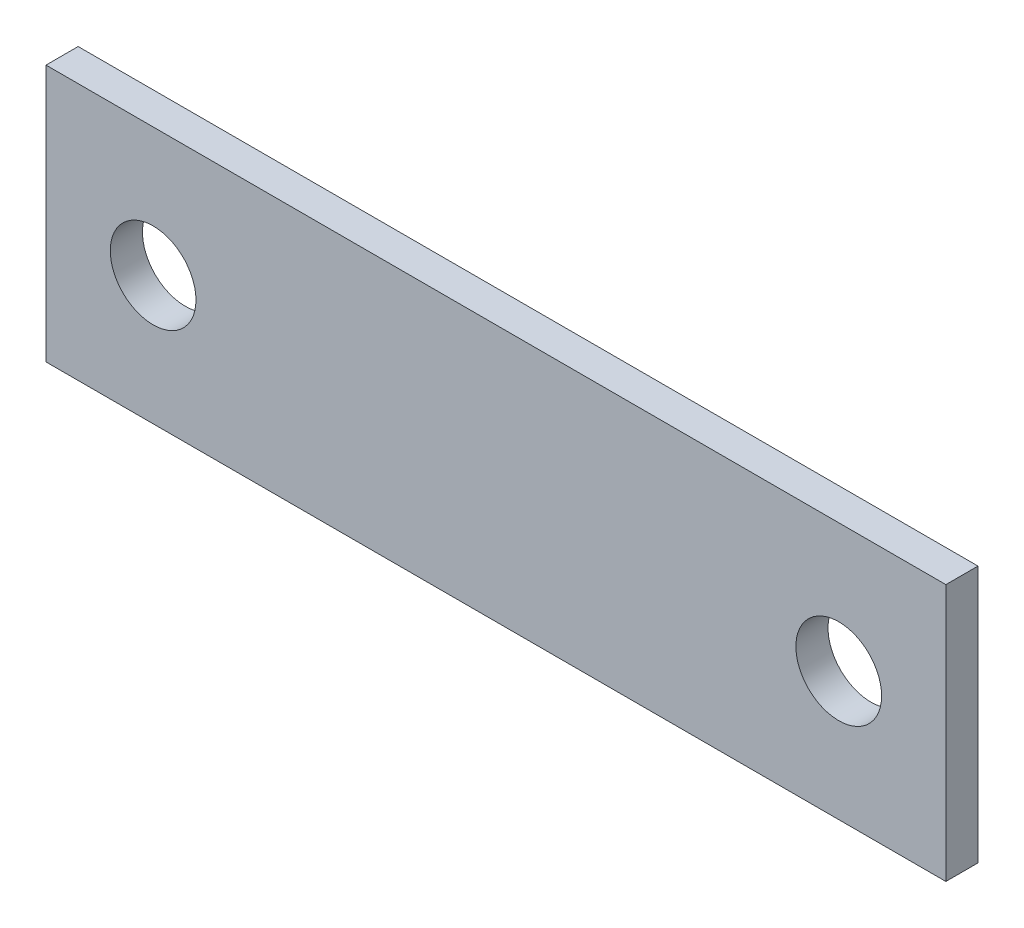
ISO-10303-21;
HEADER;
FILE_DESCRIPTION(('STEP AP214'),'2;1');
FILE_NAME('part.step','',(''),(''),'','','');
FILE_SCHEMA(('AUTOMOTIVE_DESIGN { 1 0 10303 214 1 1 1 1 }'));
ENDSEC;
DATA;
#1=APPLICATION_CONTEXT('core data for automotive mechanical design processes');
#2=APPLICATION_PROTOCOL_DEFINITION('international standard','automotive_design',2000,#1);
#3=PRODUCT_CONTEXT('',#1,'mechanical');
#4=PRODUCT('Part','Part','',(#3));
#5=PRODUCT_RELATED_PRODUCT_CATEGORY('part','',(#4));
#6=PRODUCT_DEFINITION_FORMATION('','',#4);
#7=PRODUCT_DEFINITION_CONTEXT('part definition',#1,'design');
#8=PRODUCT_DEFINITION('design','',#6,#7);
#9=PRODUCT_DEFINITION_SHAPE('','',#8);
#10=(LENGTH_UNIT() NAMED_UNIT(*) SI_UNIT(.MILLI.,.METRE.));
#11=(NAMED_UNIT(*) PLANE_ANGLE_UNIT() SI_UNIT($,.RADIAN.));
#12=(NAMED_UNIT(*) SI_UNIT($,.STERADIAN.) SOLID_ANGLE_UNIT());
#13=UNCERTAINTY_MEASURE_WITH_UNIT(LENGTH_MEASURE(1.E-05),#10,'distance_accuracy_value','');
#14=(GEOMETRIC_REPRESENTATION_CONTEXT(3) GLOBAL_UNCERTAINTY_ASSIGNED_CONTEXT((#13)) GLOBAL_UNIT_ASSIGNED_CONTEXT((#10,
#11,#12)) REPRESENTATION_CONTEXT('',''));
#15=CARTESIAN_POINT('',(0.,0.,0.));
#16=DIRECTION('',(0.,0.,1.));
#17=DIRECTION('',(1.,0.,0.));
#18=AXIS2_PLACEMENT_3D('',#15,#16,#17);
#19=CARTESIAN_POINT('',(-33.3375,9.525,2.38125));
#20=DIRECTION('',(0.,0.,1.));
#21=DIRECTION('',(1.,0.,0.));
#22=AXIS2_PLACEMENT_3D('',#19,#20,#21);
#23=PLANE('',#22);
#24=CARTESIAN_POINT('',(-25.4,0.,2.38125));
#25=DIRECTION('',(0.,0.,1.));
#26=DIRECTION('',(1.,0.,0.));
#27=AXIS2_PLACEMENT_3D('',#24,#25,#26);
#28=CIRCLE('',#27,3.175);
#29=CARTESIAN_POINT('',(-22.225,0.,2.38125));
#30=VERTEX_POINT('',#29);
#31=EDGE_CURVE('E99',#30,#30,#28,.T.);
#32=ORIENTED_EDGE('',*,*,#31,.F.);
#33=EDGE_LOOP('',(#32));
#34=FACE_BOUND('',#33,.T.);
#35=DIRECTION('',(0.,-1.,0.));
#36=VECTOR('',#35,1.);
#37=CARTESIAN_POINT('',(-33.3375,-9.52500000000001,2.38125));
#38=LINE('',#37,#36);
#39=CARTESIAN_POINT('',(-33.3375,9.525,2.38125));
#40=VERTEX_POINT('',#39);
#41=CARTESIAN_POINT('',(-33.3375,-9.52500000000001,2.38125));
#42=VERTEX_POINT('',#41);
#43=EDGE_CURVE('E84',#40,#42,#38,.T.);
#44=ORIENTED_EDGE('',*,*,#43,.T.);
#45=DIRECTION('',(1.,0.,0.));
#46=VECTOR('',#45,1.);
#47=CARTESIAN_POINT('',(33.3375,-9.525,2.38125));
#48=LINE('',#47,#46);
#49=CARTESIAN_POINT('',(33.3375,-9.525,2.38125));
#50=VERTEX_POINT('',#49);
#51=EDGE_CURVE('E79',#42,#50,#48,.T.);
#52=ORIENTED_EDGE('',*,*,#51,.T.);
#53=DIRECTION('',(0.,1.,0.));
#54=VECTOR('',#53,1.);
#55=CARTESIAN_POINT('',(33.3375,-9.525,2.38125));
#56=LINE('',#55,#54);
#57=CARTESIAN_POINT('',(33.3375,9.52500000000001,2.38125));
#58=VERTEX_POINT('',#57);
#59=EDGE_CURVE('E82',#50,#58,#56,.T.);
#60=ORIENTED_EDGE('',*,*,#59,.T.);
#61=DIRECTION('',(-1.,0.,0.));
#62=VECTOR('',#61,1.);
#63=CARTESIAN_POINT('',(33.3375,9.52500000000001,2.38125));
#64=LINE('',#63,#62);
#65=EDGE_CURVE('E49',#58,#40,#64,.T.);
#66=ORIENTED_EDGE('',*,*,#65,.T.);
#67=EDGE_LOOP('',(#44,#52,#60,#66));
#68=FACE_BOUND('',#67,.T.);
#69=CARTESIAN_POINT('',(25.4,0.,2.38125));
#70=DIRECTION('',(0.,0.,1.));
#71=DIRECTION('',(1.,0.,0.));
#72=AXIS2_PLACEMENT_3D('',#69,#70,#71);
#73=CIRCLE('',#72,3.175);
#74=CARTESIAN_POINT('',(28.575,0.,2.38125));
#75=VERTEX_POINT('',#74);
#76=EDGE_CURVE('E114',#75,#75,#73,.T.);
#77=ORIENTED_EDGE('',*,*,#76,.F.);
#78=EDGE_LOOP('',(#77));
#79=FACE_BOUND('',#78,.T.);
#80=ADVANCED_FACE('F32',(#34,#68,#79),#23,.T.);
#81=CARTESIAN_POINT('',(-33.3375,9.525,0.));
#82=DIRECTION('',(0.,0.,1.));
#83=DIRECTION('',(1.,0.,0.));
#84=AXIS2_PLACEMENT_3D('',#81,#82,#83);
#85=PLANE('',#84);
#86=CARTESIAN_POINT('',(-25.4,0.,0.));
#87=DIRECTION('',(0.,0.,1.));
#88=DIRECTION('',(1.,0.,0.));
#89=AXIS2_PLACEMENT_3D('',#86,#87,#88);
#90=CIRCLE('',#89,3.175);
#91=CARTESIAN_POINT('',(-22.225,0.,0.));
#92=VERTEX_POINT('',#91);
#93=EDGE_CURVE('E111',#92,#92,#90,.T.);
#94=ORIENTED_EDGE('',*,*,#93,.T.);
#95=EDGE_LOOP('',(#94));
#96=FACE_BOUND('',#95,.T.);
#97=DIRECTION('',(0.,-1.,0.));
#98=VECTOR('',#97,1.);
#99=CARTESIAN_POINT('',(-33.3375,-9.52500000000001,0.));
#100=LINE('',#99,#98);
#101=CARTESIAN_POINT('',(-33.3375,9.525,0.));
#102=VERTEX_POINT('',#101);
#103=CARTESIAN_POINT('',(-33.3375,-9.52500000000001,0.));
#104=VERTEX_POINT('',#103);
#105=EDGE_CURVE('E96',#102,#104,#100,.T.);
#106=ORIENTED_EDGE('',*,*,#105,.F.);
#107=DIRECTION('',(-1.,0.,0.));
#108=VECTOR('',#107,1.);
#109=CARTESIAN_POINT('',(33.3375,9.52500000000001,0.));
#110=LINE('',#109,#108);
#111=CARTESIAN_POINT('',(33.3375,9.52500000000001,0.));
#112=VERTEX_POINT('',#111);
#113=EDGE_CURVE('E72',#112,#102,#110,.T.);
#114=ORIENTED_EDGE('',*,*,#113,.F.);
#115=DIRECTION('',(0.,1.,0.));
#116=VECTOR('',#115,1.);
#117=CARTESIAN_POINT('',(33.3375,-9.525,0.));
#118=LINE('',#117,#116);
#119=CARTESIAN_POINT('',(33.3375,-9.525,0.));
#120=VERTEX_POINT('',#119);
#121=EDGE_CURVE('E66',#120,#112,#118,.T.);
#122=ORIENTED_EDGE('',*,*,#121,.F.);
#123=DIRECTION('',(1.,0.,0.));
#124=VECTOR('',#123,1.);
#125=CARTESIAN_POINT('',(33.3375,-9.525,0.));
#126=LINE('',#125,#124);
#127=EDGE_CURVE('E88',#104,#120,#126,.T.);
#128=ORIENTED_EDGE('',*,*,#127,.F.);
#129=EDGE_LOOP('',(#106,#114,#122,#128));
#130=FACE_BOUND('',#129,.T.);
#131=CARTESIAN_POINT('',(25.4,0.,0.));
#132=DIRECTION('',(0.,0.,1.));
#133=DIRECTION('',(1.,0.,0.));
#134=AXIS2_PLACEMENT_3D('',#131,#132,#133);
#135=CIRCLE('',#134,3.175);
#136=CARTESIAN_POINT('',(28.575,0.,0.));
#137=VERTEX_POINT('',#136);
#138=EDGE_CURVE('E117',#137,#137,#135,.T.);
#139=ORIENTED_EDGE('',*,*,#138,.T.);
#140=EDGE_LOOP('',(#139));
#141=FACE_BOUND('',#140,.T.);
#142=ADVANCED_FACE('F107',(#96,#130,#141),#85,.F.);
#143=CARTESIAN_POINT('',(-33.3375,-9.52500000000001,2.38125));
#144=DIRECTION('',(1.,0.,0.));
#145=DIRECTION('',(0.,0.,-1.));
#146=AXIS2_PLACEMENT_3D('',#143,#144,#145);
#147=PLANE('',#146);
#148=ORIENTED_EDGE('',*,*,#105,.T.);
#149=DIRECTION('',(0.,0.,-1.));
#150=VECTOR('',#149,1.);
#151=CARTESIAN_POINT('',(-33.3375,-9.52500000000001,2.38125));
#152=LINE('',#151,#150);
#153=EDGE_CURVE('E11',#42,#104,#152,.T.);
#154=ORIENTED_EDGE('',*,*,#153,.F.);
#155=ORIENTED_EDGE('',*,*,#43,.F.);
#156=DIRECTION('',(0.,0.,-1.));
#157=VECTOR('',#156,1.);
#158=CARTESIAN_POINT('',(-33.3375,9.525,2.38125));
#159=LINE('',#158,#157);
#160=EDGE_CURVE('E92',#40,#102,#159,.T.);
#161=ORIENTED_EDGE('',*,*,#160,.T.);
#162=EDGE_LOOP('',(#148,#154,#155,#161));
#163=FACE_BOUND('',#162,.T.);
#164=ADVANCED_FACE('F34',(#163),#147,.F.);
#165=CARTESIAN_POINT('',(33.3375,-9.525,2.38125));
#166=DIRECTION('',(0.,1.,0.));
#167=DIRECTION('',(-1.,0.,0.));
#168=AXIS2_PLACEMENT_3D('',#165,#166,#167);
#169=PLANE('',#168);
#170=ORIENTED_EDGE('',*,*,#127,.T.);
#171=DIRECTION('',(0.,0.,-1.));
#172=VECTOR('',#171,1.);
#173=CARTESIAN_POINT('',(33.3375,-9.525,2.38125));
#174=LINE('',#173,#172);
#175=EDGE_CURVE('E41',#50,#120,#174,.T.);
#176=ORIENTED_EDGE('',*,*,#175,.F.);
#177=ORIENTED_EDGE('',*,*,#51,.F.);
#178=ORIENTED_EDGE('',*,*,#153,.T.);
#179=EDGE_LOOP('',(#170,#176,#177,#178));
#180=FACE_BOUND('',#179,.T.);
#181=ADVANCED_FACE('F87',(#180),#169,.F.);
#182=CARTESIAN_POINT('',(33.3375,-9.525,2.38125));
#183=DIRECTION('',(-1.,0.,0.));
#184=DIRECTION('',(0.,0.,1.));
#185=AXIS2_PLACEMENT_3D('',#182,#183,#184);
#186=PLANE('',#185);
#187=ORIENTED_EDGE('',*,*,#121,.T.);
#188=DIRECTION('',(0.,0.,-1.));
#189=VECTOR('',#188,1.);
#190=CARTESIAN_POINT('',(33.3375,9.52500000000001,2.38125));
#191=LINE('',#190,#189);
#192=EDGE_CURVE('E89',#58,#112,#191,.T.);
#193=ORIENTED_EDGE('',*,*,#192,.F.);
#194=ORIENTED_EDGE('',*,*,#59,.F.);
#195=ORIENTED_EDGE('',*,*,#175,.T.);
#196=EDGE_LOOP('',(#187,#193,#194,#195));
#197=FACE_BOUND('',#196,.T.);
#198=ADVANCED_FACE('F90',(#197),#186,.F.);
#199=CARTESIAN_POINT('',(33.3375,9.52500000000001,2.38125));
#200=DIRECTION('',(0.,-1.,0.));
#201=DIRECTION('',(1.,0.,0.));
#202=AXIS2_PLACEMENT_3D('',#199,#200,#201);
#203=PLANE('',#202);
#204=ORIENTED_EDGE('',*,*,#113,.T.);
#205=ORIENTED_EDGE('',*,*,#160,.F.);
#206=ORIENTED_EDGE('',*,*,#65,.F.);
#207=ORIENTED_EDGE('',*,*,#192,.T.);
#208=EDGE_LOOP('',(#204,#205,#206,#207));
#209=FACE_BOUND('',#208,.T.);
#210=ADVANCED_FACE('F104',(#209),#203,.F.);
#211=CARTESIAN_POINT('',(-25.4,0.,2.38125));
#212=DIRECTION('',(0.,0.,-1.));
#213=DIRECTION('',(-1.,0.,0.));
#214=AXIS2_PLACEMENT_3D('',#211,#212,#213);
#215=CYLINDRICAL_SURFACE('',#214,3.175);
#216=ORIENTED_EDGE('',*,*,#31,.T.);
#217=EDGE_LOOP('',(#216));
#218=FACE_BOUND('',#217,.T.);
#219=ORIENTED_EDGE('',*,*,#93,.F.);
#220=EDGE_LOOP('',(#219));
#221=FACE_BOUND('',#220,.T.);
#222=ADVANCED_FACE('F135',(#218,#221),#215,.F.);
#223=CARTESIAN_POINT('',(25.4,0.,2.38125));
#224=DIRECTION('',(0.,0.,-1.));
#225=DIRECTION('',(-1.,0.,0.));
#226=AXIS2_PLACEMENT_3D('',#223,#224,#225);
#227=CYLINDRICAL_SURFACE('',#226,3.175);
#228=ORIENTED_EDGE('',*,*,#76,.T.);
#229=EDGE_LOOP('',(#228));
#230=FACE_BOUND('',#229,.T.);
#231=ORIENTED_EDGE('',*,*,#138,.F.);
#232=EDGE_LOOP('',(#231));
#233=FACE_BOUND('',#232,.T.);
#234=ADVANCED_FACE('F123',(#230,#233),#227,.F.);
#235=CLOSED_SHELL('',(#80,#142,#164,#181,#198,#210,#222,#234));
#236=MANIFOLD_SOLID_BREP('B2',#235);
#237=ADVANCED_BREP_SHAPE_REPRESENTATION('',(#18,#236),#14);
#238=SHAPE_DEFINITION_REPRESENTATION(#9,#237);
ENDSEC;
END-ISO-10303-21;
